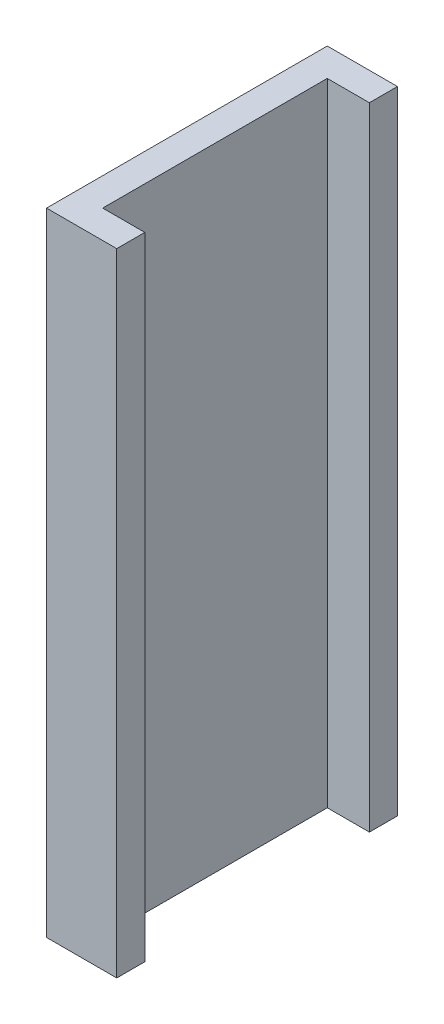
ISO-10303-21;
HEADER;
FILE_DESCRIPTION(('STEP AP214'),'2;1');
FILE_NAME('part.step','',(''),(''),'','','');
FILE_SCHEMA(('AUTOMOTIVE_DESIGN { 1 0 10303 214 1 1 1 1 }'));
ENDSEC;
DATA;
#1=APPLICATION_CONTEXT('core data for automotive mechanical design processes');
#2=APPLICATION_PROTOCOL_DEFINITION('international standard','automotive_design',2000,#1);
#3=PRODUCT_CONTEXT('',#1,'mechanical');
#4=PRODUCT('Part','Part','',(#3));
#5=PRODUCT_RELATED_PRODUCT_CATEGORY('part','',(#4));
#6=PRODUCT_DEFINITION_FORMATION('','',#4);
#7=PRODUCT_DEFINITION_CONTEXT('part definition',#1,'design');
#8=PRODUCT_DEFINITION('design','',#6,#7);
#9=PRODUCT_DEFINITION_SHAPE('','',#8);
#10=(LENGTH_UNIT() NAMED_UNIT(*) SI_UNIT(.MILLI.,.METRE.));
#11=(NAMED_UNIT(*) PLANE_ANGLE_UNIT() SI_UNIT($,.RADIAN.));
#12=(NAMED_UNIT(*) SI_UNIT($,.STERADIAN.) SOLID_ANGLE_UNIT());
#13=UNCERTAINTY_MEASURE_WITH_UNIT(LENGTH_MEASURE(1.E-05),#10,'distance_accuracy_value','');
#14=(GEOMETRIC_REPRESENTATION_CONTEXT(3) GLOBAL_UNCERTAINTY_ASSIGNED_CONTEXT((#13)) GLOBAL_UNIT_ASSIGNED_CONTEXT((#10,
#11,#12)) REPRESENTATION_CONTEXT('',''));
#15=CARTESIAN_POINT('',(0.,0.,0.));
#16=DIRECTION('',(0.,0.,1.));
#17=DIRECTION('',(1.,0.,0.));
#18=AXIS2_PLACEMENT_3D('',#15,#16,#17);
#19=CARTESIAN_POINT('',(0.,0.,0.));
#20=DIRECTION('',(1.,0.,0.));
#21=DIRECTION('',(0.,0.,1.));
#22=AXIS2_PLACEMENT_3D('',#19,#20,#21);
#23=PLANE('',#22);
#24=DIRECTION('',(0.,1.,0.));
#25=VECTOR('',#24,1.);
#26=CARTESIAN_POINT('',(0.,0.,0.6));
#27=LINE('',#26,#25);
#28=CARTESIAN_POINT('',(0.,0.,0.6));
#29=VERTEX_POINT('',#28);
#30=CARTESIAN_POINT('',(0.,1.35,0.6));
#31=VERTEX_POINT('',#30);
#32=EDGE_CURVE('E11',#29,#31,#27,.T.);
#33=ORIENTED_EDGE('',*,*,#32,.T.);
#34=DIRECTION('',(0.,0.,1.));
#35=VECTOR('',#34,1.);
#36=CARTESIAN_POINT('',(0.,1.35,0.));
#37=LINE('',#36,#35);
#38=CARTESIAN_POINT('',(0.,1.35,0.));
#39=VERTEX_POINT('',#38);
#40=EDGE_CURVE('E143',#39,#31,#37,.T.);
#41=ORIENTED_EDGE('',*,*,#40,.F.);
#42=DIRECTION('',(0.,1.,0.));
#43=VECTOR('',#42,1.);
#44=CARTESIAN_POINT('',(0.,0.,0.));
#45=LINE('',#44,#43);
#46=CARTESIAN_POINT('',(0.,0.,0.));
#47=VERTEX_POINT('',#46);
#48=EDGE_CURVE('E138',#47,#39,#45,.T.);
#49=ORIENTED_EDGE('',*,*,#48,.F.);
#50=DIRECTION('',(0.,0.,1.));
#51=VECTOR('',#50,1.);
#52=CARTESIAN_POINT('',(0.,0.,0.));
#53=LINE('',#52,#51);
#54=EDGE_CURVE('E131',#47,#29,#53,.T.);
#55=ORIENTED_EDGE('',*,*,#54,.T.);
#56=EDGE_LOOP('',(#33,#41,#49,#55));
#57=FACE_BOUND('',#56,.T.);
#58=ADVANCED_FACE('F17',(#57),#23,.F.);
#59=CARTESIAN_POINT('',(0.,0.,0.));
#60=DIRECTION('',(0.,1.,0.));
#61=DIRECTION('',(0.,0.,1.));
#62=AXIS2_PLACEMENT_3D('',#59,#60,#61);
#63=PLANE('',#62);
#64=DIRECTION('',(1.,0.,0.));
#65=VECTOR('',#64,1.);
#66=CARTESIAN_POINT('',(0.06,0.,0.06));
#67=LINE('',#66,#65);
#68=CARTESIAN_POINT('',(0.06,0.,0.06));
#69=VERTEX_POINT('',#68);
#70=CARTESIAN_POINT('',(0.15,0.,0.06));
#71=VERTEX_POINT('',#70);
#72=EDGE_CURVE('E24',#69,#71,#67,.T.);
#73=ORIENTED_EDGE('',*,*,#72,.F.);
#74=DIRECTION('',(0.,0.,1.));
#75=VECTOR('',#74,1.);
#76=CARTESIAN_POINT('',(0.06,0.,0.06));
#77=LINE('',#76,#75);
#78=CARTESIAN_POINT('',(0.06,0.,0.54));
#79=VERTEX_POINT('',#78);
#80=EDGE_CURVE('E141',#69,#79,#77,.T.);
#81=ORIENTED_EDGE('',*,*,#80,.T.);
#82=DIRECTION('',(1.,0.,0.));
#83=VECTOR('',#82,1.);
#84=CARTESIAN_POINT('',(0.06,0.,0.54));
#85=LINE('',#84,#83);
#86=CARTESIAN_POINT('',(0.15,0.,0.54));
#87=VERTEX_POINT('',#86);
#88=EDGE_CURVE('E102',#79,#87,#85,.T.);
#89=ORIENTED_EDGE('',*,*,#88,.T.);
#90=DIRECTION('',(0.,0.,1.));
#91=VECTOR('',#90,1.);
#92=CARTESIAN_POINT('',(0.15,0.,0.54));
#93=LINE('',#92,#91);
#94=CARTESIAN_POINT('',(0.15,0.,0.6));
#95=VERTEX_POINT('',#94);
#96=EDGE_CURVE('E123',#87,#95,#93,.T.);
#97=ORIENTED_EDGE('',*,*,#96,.T.);
#98=DIRECTION('',(1.,0.,0.));
#99=VECTOR('',#98,1.);
#100=CARTESIAN_POINT('',(0.,0.,0.6));
#101=LINE('',#100,#99);
#102=EDGE_CURVE('E134',#29,#95,#101,.T.);
#103=ORIENTED_EDGE('',*,*,#102,.F.);
#104=ORIENTED_EDGE('',*,*,#54,.F.);
#105=DIRECTION('',(1.,0.,0.));
#106=VECTOR('',#105,1.);
#107=CARTESIAN_POINT('',(0.,0.,0.));
#108=LINE('',#107,#106);
#109=CARTESIAN_POINT('',(0.15,0.,0.));
#110=VERTEX_POINT('',#109);
#111=EDGE_CURVE('E111',#47,#110,#108,.T.);
#112=ORIENTED_EDGE('',*,*,#111,.T.);
#113=DIRECTION('',(0.,0.,1.));
#114=VECTOR('',#113,1.);
#115=CARTESIAN_POINT('',(0.15,0.,0.));
#116=LINE('',#115,#114);
#117=EDGE_CURVE('E121',#110,#71,#116,.T.);
#118=ORIENTED_EDGE('',*,*,#117,.T.);
#119=EDGE_LOOP('',(#73,#81,#89,#97,#103,#104,#112,#118));
#120=FACE_BOUND('',#119,.T.);
#121=ADVANCED_FACE('F150',(#120),#63,.F.);
#122=CARTESIAN_POINT('',(0.,0.,0.6));
#123=DIRECTION('',(0.,0.,1.));
#124=DIRECTION('',(1.,0.,0.));
#125=AXIS2_PLACEMENT_3D('',#122,#123,#124);
#126=PLANE('',#125);
#127=ORIENTED_EDGE('',*,*,#32,.F.);
#128=ORIENTED_EDGE('',*,*,#102,.T.);
#129=DIRECTION('',(0.,1.,0.));
#130=VECTOR('',#129,1.);
#131=CARTESIAN_POINT('',(0.15,0.,0.6));
#132=LINE('',#131,#130);
#133=CARTESIAN_POINT('',(0.15,1.35,0.6));
#134=VERTEX_POINT('',#133);
#135=EDGE_CURVE('E126',#95,#134,#132,.T.);
#136=ORIENTED_EDGE('',*,*,#135,.T.);
#137=DIRECTION('',(1.,0.,0.));
#138=VECTOR('',#137,1.);
#139=CARTESIAN_POINT('',(0.,1.35,0.6));
#140=LINE('',#139,#138);
#141=EDGE_CURVE('E116',#31,#134,#140,.T.);
#142=ORIENTED_EDGE('',*,*,#141,.F.);
#143=EDGE_LOOP('',(#127,#128,#136,#142));
#144=FACE_BOUND('',#143,.T.);
#145=ADVANCED_FACE('F159',(#144),#126,.T.);
#146=CARTESIAN_POINT('',(0.,1.35,0.));
#147=DIRECTION('',(0.,1.,0.));
#148=DIRECTION('',(0.,0.,1.));
#149=AXIS2_PLACEMENT_3D('',#146,#147,#148);
#150=PLANE('',#149);
#151=DIRECTION('',(0.,0.,1.));
#152=VECTOR('',#151,1.);
#153=CARTESIAN_POINT('',(0.15,1.35,0.));
#154=LINE('',#153,#152);
#155=CARTESIAN_POINT('',(0.15,1.35,0.));
#156=VERTEX_POINT('',#155);
#157=CARTESIAN_POINT('',(0.15,1.35,0.06));
#158=VERTEX_POINT('',#157);
#159=EDGE_CURVE('E136',#156,#158,#154,.T.);
#160=ORIENTED_EDGE('',*,*,#159,.F.);
#161=DIRECTION('',(1.,0.,0.));
#162=VECTOR('',#161,1.);
#163=CARTESIAN_POINT('',(0.,1.35,0.));
#164=LINE('',#163,#162);
#165=EDGE_CURVE('E128',#39,#156,#164,.T.);
#166=ORIENTED_EDGE('',*,*,#165,.F.);
#167=ORIENTED_EDGE('',*,*,#40,.T.);
#168=ORIENTED_EDGE('',*,*,#141,.T.);
#169=DIRECTION('',(0.,0.,1.));
#170=VECTOR('',#169,1.);
#171=CARTESIAN_POINT('',(0.15,1.35,0.54));
#172=LINE('',#171,#170);
#173=CARTESIAN_POINT('',(0.15,1.35,0.54));
#174=VERTEX_POINT('',#173);
#175=EDGE_CURVE('E85',#174,#134,#172,.T.);
#176=ORIENTED_EDGE('',*,*,#175,.F.);
#177=DIRECTION('',(1.,0.,0.));
#178=VECTOR('',#177,1.);
#179=CARTESIAN_POINT('',(0.06,1.35,0.54));
#180=LINE('',#179,#178);
#181=CARTESIAN_POINT('',(0.06,1.35,0.54));
#182=VERTEX_POINT('',#181);
#183=EDGE_CURVE('E78',#182,#174,#180,.T.);
#184=ORIENTED_EDGE('',*,*,#183,.F.);
#185=DIRECTION('',(0.,0.,1.));
#186=VECTOR('',#185,1.);
#187=CARTESIAN_POINT('',(0.06,1.35,0.06));
#188=LINE('',#187,#186);
#189=CARTESIAN_POINT('',(0.06,1.35,0.06));
#190=VERTEX_POINT('',#189);
#191=EDGE_CURVE('E82',#190,#182,#188,.T.);
#192=ORIENTED_EDGE('',*,*,#191,.F.);
#193=DIRECTION('',(1.,0.,0.));
#194=VECTOR('',#193,1.);
#195=CARTESIAN_POINT('',(0.06,1.35,0.06));
#196=LINE('',#195,#194);
#197=EDGE_CURVE('E114',#190,#158,#196,.T.);
#198=ORIENTED_EDGE('',*,*,#197,.T.);
#199=EDGE_LOOP('',(#160,#166,#167,#168,#176,#184,#192,#198));
#200=FACE_BOUND('',#199,.T.);
#201=ADVANCED_FACE('F80',(#200),#150,.T.);
#202=CARTESIAN_POINT('',(0.,0.,0.));
#203=DIRECTION('',(0.,0.,1.));
#204=DIRECTION('',(1.,0.,0.));
#205=AXIS2_PLACEMENT_3D('',#202,#203,#204);
#206=PLANE('',#205);
#207=ORIENTED_EDGE('',*,*,#165,.T.);
#208=DIRECTION('',(0.,1.,0.));
#209=VECTOR('',#208,1.);
#210=CARTESIAN_POINT('',(0.15,0.,0.));
#211=LINE('',#210,#209);
#212=EDGE_CURVE('E118',#110,#156,#211,.T.);
#213=ORIENTED_EDGE('',*,*,#212,.F.);
#214=ORIENTED_EDGE('',*,*,#111,.F.);
#215=ORIENTED_EDGE('',*,*,#48,.T.);
#216=EDGE_LOOP('',(#207,#213,#214,#215));
#217=FACE_BOUND('',#216,.T.);
#218=ADVANCED_FACE('F155',(#217),#206,.F.);
#219=CARTESIAN_POINT('',(0.15,0.,0.));
#220=DIRECTION('',(1.,0.,0.));
#221=DIRECTION('',(0.,0.,1.));
#222=AXIS2_PLACEMENT_3D('',#219,#220,#221);
#223=PLANE('',#222);
#224=ORIENTED_EDGE('',*,*,#117,.F.);
#225=ORIENTED_EDGE('',*,*,#212,.T.);
#226=ORIENTED_EDGE('',*,*,#159,.T.);
#227=DIRECTION('',(0.,-1.,0.));
#228=VECTOR('',#227,1.);
#229=CARTESIAN_POINT('',(0.15,1.35,0.06));
#230=LINE('',#229,#228);
#231=EDGE_CURVE('E90',#158,#71,#230,.T.);
#232=ORIENTED_EDGE('',*,*,#231,.T.);
#233=EDGE_LOOP('',(#224,#225,#226,#232));
#234=FACE_BOUND('',#233,.T.);
#235=ADVANCED_FACE('F148',(#234),#223,.T.);
#236=CARTESIAN_POINT('',(0.06,0.,0.06));
#237=DIRECTION('',(0.,0.,1.));
#238=DIRECTION('',(1.,0.,0.));
#239=AXIS2_PLACEMENT_3D('',#236,#237,#238);
#240=PLANE('',#239);
#241=ORIENTED_EDGE('',*,*,#197,.F.);
#242=DIRECTION('',(0.,1.,0.));
#243=VECTOR('',#242,1.);
#244=CARTESIAN_POINT('',(0.06,0.,0.06));
#245=LINE('',#244,#243);
#246=EDGE_CURVE('E98',#69,#190,#245,.T.);
#247=ORIENTED_EDGE('',*,*,#246,.F.);
#248=ORIENTED_EDGE('',*,*,#72,.T.);
#249=ORIENTED_EDGE('',*,*,#231,.F.);
#250=EDGE_LOOP('',(#241,#247,#248,#249));
#251=FACE_BOUND('',#250,.T.);
#252=ADVANCED_FACE('F146',(#251),#240,.T.);
#253=CARTESIAN_POINT('',(0.06,0.,0.06));
#254=DIRECTION('',(1.,0.,0.));
#255=DIRECTION('',(0.,0.,1.));
#256=AXIS2_PLACEMENT_3D('',#253,#254,#255);
#257=PLANE('',#256);
#258=ORIENTED_EDGE('',*,*,#80,.F.);
#259=ORIENTED_EDGE('',*,*,#246,.T.);
#260=ORIENTED_EDGE('',*,*,#191,.T.);
#261=DIRECTION('',(0.,1.,0.));
#262=VECTOR('',#261,1.);
#263=CARTESIAN_POINT('',(0.06,0.,0.54));
#264=LINE('',#263,#262);
#265=EDGE_CURVE('E96',#79,#182,#264,.T.);
#266=ORIENTED_EDGE('',*,*,#265,.F.);
#267=EDGE_LOOP('',(#258,#259,#260,#266));
#268=FACE_BOUND('',#267,.T.);
#269=ADVANCED_FACE('F95',(#268),#257,.T.);
#270=CARTESIAN_POINT('',(0.06,0.,0.54));
#271=DIRECTION('',(0.,0.,1.));
#272=DIRECTION('',(1.,0.,0.));
#273=AXIS2_PLACEMENT_3D('',#270,#271,#272);
#274=PLANE('',#273);
#275=DIRECTION('',(0.,-1.,0.));
#276=VECTOR('',#275,1.);
#277=CARTESIAN_POINT('',(0.15,1.35,0.54));
#278=LINE('',#277,#276);
#279=EDGE_CURVE('E107',#174,#87,#278,.T.);
#280=ORIENTED_EDGE('',*,*,#279,.T.);
#281=ORIENTED_EDGE('',*,*,#88,.F.);
#282=ORIENTED_EDGE('',*,*,#265,.T.);
#283=ORIENTED_EDGE('',*,*,#183,.T.);
#284=EDGE_LOOP('',(#280,#281,#282,#283));
#285=FACE_BOUND('',#284,.T.);
#286=ADVANCED_FACE('F101',(#285),#274,.F.);
#287=CARTESIAN_POINT('',(0.15,0.,0.));
#288=DIRECTION('',(1.,0.,0.));
#289=DIRECTION('',(0.,0.,1.));
#290=AXIS2_PLACEMENT_3D('',#287,#288,#289);
#291=PLANE('',#290);
#292=ORIENTED_EDGE('',*,*,#96,.F.);
#293=ORIENTED_EDGE('',*,*,#279,.F.);
#294=ORIENTED_EDGE('',*,*,#175,.T.);
#295=ORIENTED_EDGE('',*,*,#135,.F.);
#296=EDGE_LOOP('',(#292,#293,#294,#295));
#297=FACE_BOUND('',#296,.T.);
#298=ADVANCED_FACE('F163',(#297),#291,.T.);
#299=CLOSED_SHELL('',(#58,#121,#145,#201,#218,#235,#252,#269,#286,#298));
#300=MANIFOLD_SOLID_BREP('B1',#299);
#301=ADVANCED_BREP_SHAPE_REPRESENTATION('',(#18,#300),#14);
#302=SHAPE_DEFINITION_REPRESENTATION(#9,#301);
ENDSEC;
END-ISO-10303-21;
